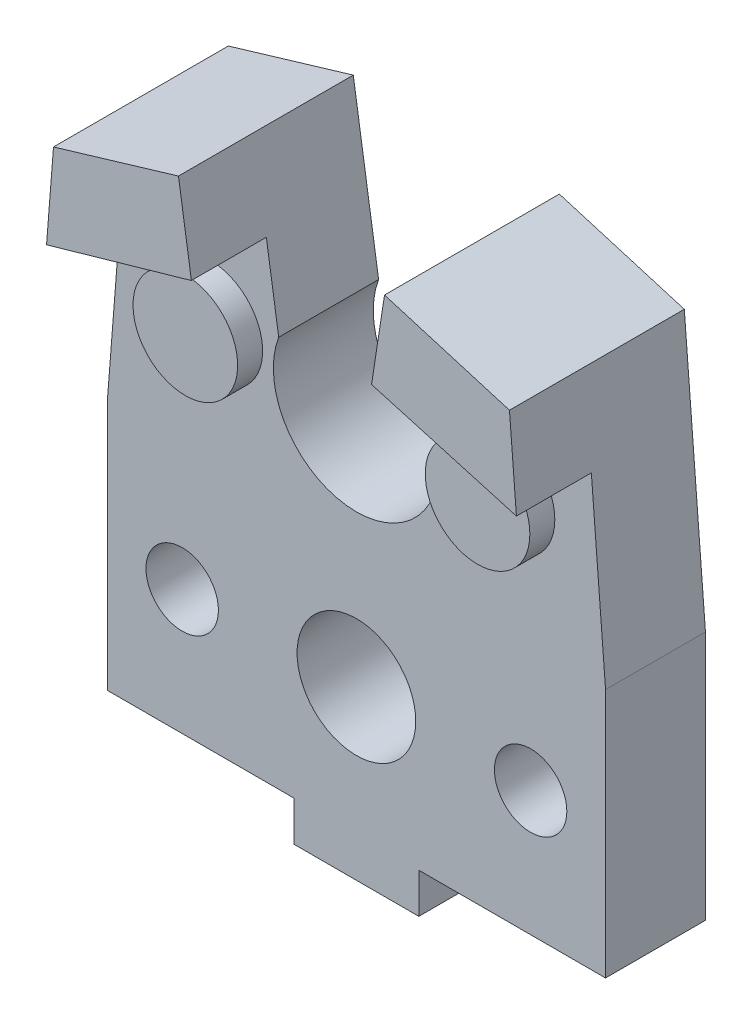
ISO-10303-21;
HEADER;
FILE_DESCRIPTION(('STEP AP214'),'2;1');
FILE_NAME('part.step','',(''),(''),'','','');
FILE_SCHEMA(('AUTOMOTIVE_DESIGN { 1 0 10303 214 1 1 1 1 }'));
ENDSEC;
DATA;
#1=APPLICATION_CONTEXT('core data for automotive mechanical design processes');
#2=APPLICATION_PROTOCOL_DEFINITION('international standard','automotive_design',2000,#1);
#3=PRODUCT_CONTEXT('',#1,'mechanical');
#4=PRODUCT('Part','Part','',(#3));
#5=PRODUCT_RELATED_PRODUCT_CATEGORY('part','',(#4));
#6=PRODUCT_DEFINITION_FORMATION('','',#4);
#7=PRODUCT_DEFINITION_CONTEXT('part definition',#1,'design');
#8=PRODUCT_DEFINITION('design','',#6,#7);
#9=PRODUCT_DEFINITION_SHAPE('','',#8);
#10=(LENGTH_UNIT() NAMED_UNIT(*) SI_UNIT(.MILLI.,.METRE.));
#11=(NAMED_UNIT(*) PLANE_ANGLE_UNIT() SI_UNIT($,.RADIAN.));
#12=(NAMED_UNIT(*) SI_UNIT($,.STERADIAN.) SOLID_ANGLE_UNIT());
#13=UNCERTAINTY_MEASURE_WITH_UNIT(LENGTH_MEASURE(1.E-05),#10,'distance_accuracy_value','');
#14=(GEOMETRIC_REPRESENTATION_CONTEXT(3) GLOBAL_UNCERTAINTY_ASSIGNED_CONTEXT((#13)) GLOBAL_UNIT_ASSIGNED_CONTEXT((#10,
#11,#12)) REPRESENTATION_CONTEXT('',''));
#15=CARTESIAN_POINT('',(0.,0.,0.));
#16=DIRECTION('',(0.,0.,1.));
#17=DIRECTION('',(1.,0.,0.));
#18=AXIS2_PLACEMENT_3D('',#15,#16,#17);
#19=CARTESIAN_POINT('',(0.,14.5,4.));
#20=DIRECTION('',(0.,0.,1.));
#21=DIRECTION('',(1.,0.,0.));
#22=AXIS2_PLACEMENT_3D('',#19,#20,#21);
#23=PLANE('',#22);
#24=CARTESIAN_POINT('',(5.84963031329266,14.8759344215206,4.));
#25=DIRECTION('',(0.,0.,1.));
#26=DIRECTION('',(1.,0.,0.));
#27=AXIS2_PLACEMENT_3D('',#24,#25,#26);
#28=CIRCLE('',#27,2.09451761320757);
#29=CARTESIAN_POINT('',(7.94414792650023,14.8759344215206,4.));
#30=VERTEX_POINT('',#29);
#31=EDGE_CURVE('E245',#30,#30,#28,.T.);
#32=ORIENTED_EDGE('',*,*,#31,.F.);
#33=EDGE_LOOP('',(#32));
#34=FACE_BOUND('',#33,.T.);
#35=CARTESIAN_POINT('',(0.,5.1,4.));
#36=DIRECTION('',(0.,0.,1.));
#37=DIRECTION('',(1.,0.,0.));
#38=AXIS2_PLACEMENT_3D('',#35,#36,#37);
#39=CIRCLE('',#38,2.375);
#40=CARTESIAN_POINT('',(2.375,5.1,4.));
#41=VERTEX_POINT('',#40);
#42=EDGE_CURVE('E253',#41,#41,#39,.T.);
#43=ORIENTED_EDGE('',*,*,#42,.F.);
#44=EDGE_LOOP('',(#43));
#45=FACE_BOUND('',#44,.T.);
#46=CARTESIAN_POINT('',(6.975,5.,4.));
#47=DIRECTION('',(0.,0.,1.));
#48=DIRECTION('',(1.,0.,0.));
#49=AXIS2_PLACEMENT_3D('',#46,#47,#48);
#50=CIRCLE('',#49,1.45);
#51=CARTESIAN_POINT('',(8.425,5.,4.));
#52=VERTEX_POINT('',#51);
#53=EDGE_CURVE('E263',#52,#52,#50,.T.);
#54=ORIENTED_EDGE('',*,*,#53,.F.);
#55=EDGE_LOOP('',(#54));
#56=FACE_BOUND('',#55,.T.);
#57=CARTESIAN_POINT('',(-6.975,5.,4.));
#58=DIRECTION('',(0.,0.,-1.));
#59=DIRECTION('',(-1.,0.,0.));
#60=AXIS2_PLACEMENT_3D('',#57,#58,#59);
#61=CIRCLE('',#60,1.45);
#62=CARTESIAN_POINT('',(-8.425,5.,4.));
#63=VERTEX_POINT('',#62);
#64=EDGE_CURVE('E259',#63,#63,#61,.T.);
#65=ORIENTED_EDGE('',*,*,#64,.T.);
#66=EDGE_LOOP('',(#65));
#67=FACE_BOUND('',#66,.T.);
#68=CARTESIAN_POINT('',(-5.84963031329266,14.8759344215206,4.));
#69=DIRECTION('',(0.,0.,1.));
#70=DIRECTION('',(-1.,0.,0.));
#71=AXIS2_PLACEMENT_3D('',#68,#69,#70);
#72=CIRCLE('',#71,2.09451761320757);
#73=CARTESIAN_POINT('',(-7.94414792650023,14.8759344215206,4.));
#74=VERTEX_POINT('',#73);
#75=EDGE_CURVE('E240',#74,#74,#72,.T.);
#76=ORIENTED_EDGE('',*,*,#75,.F.);
#77=EDGE_LOOP('',(#76));
#78=FACE_BOUND('',#77,.T.);
#79=DIRECTION('',(0.152370189997375,-0.988323492182678,0.));
#80=VECTOR('',#79,1.);
#81=CARTESIAN_POINT('',(-4.12514475526542,22.2565409840726,4.));
#82=LINE('',#81,#80);
#83=CARTESIAN_POINT('',(-3.60665876155312,18.8934691918646,4.));
#84=VERTEX_POINT('',#83);
#85=CARTESIAN_POINT('',(-3.11046620299916,15.675,4.));
#86=VERTEX_POINT('',#85);
#87=EDGE_CURVE('E444',#84,#86,#82,.T.);
#88=ORIENTED_EDGE('',*,*,#87,.F.);
#89=DIRECTION('',(0.961295074943608,0.275520922779311,0.));
#90=VECTOR('',#89,1.);
#91=CARTESIAN_POINT('',(-3.60665876155312,18.8934691918646,4.));
#92=LINE('',#91,#90);
#93=CARTESIAN_POINT('',(-9.40604841307085,17.2312811395262,4.));
#94=VERTEX_POINT('',#93);
#95=EDGE_CURVE('E203',#94,#84,#92,.T.);
#96=ORIENTED_EDGE('',*,*,#95,.F.);
#97=DIRECTION('',(0.0784368198986132,0.996919086628495,0.));
#98=VECTOR('',#97,1.);
#99=CARTESIAN_POINT('',(-9.975,10.,4.));
#100=LINE('',#99,#98);
#101=CARTESIAN_POINT('',(-9.975,10.,4.));
#102=VERTEX_POINT('',#101);
#103=EDGE_CURVE('E209',#102,#94,#100,.T.);
#104=ORIENTED_EDGE('',*,*,#103,.F.);
#105=DIRECTION('',(0.,1.,0.));
#106=VECTOR('',#105,1.);
#107=CARTESIAN_POINT('',(-9.975,0.,4.));
#108=LINE('',#107,#106);
#109=CARTESIAN_POINT('',(-9.975,0.,4.));
#110=VERTEX_POINT('',#109);
#111=EDGE_CURVE('E416',#110,#102,#108,.T.);
#112=ORIENTED_EDGE('',*,*,#111,.F.);
#113=DIRECTION('',(1.,0.,0.));
#114=VECTOR('',#113,1.);
#115=CARTESIAN_POINT('',(-9.975,0.,4.));
#116=LINE('',#115,#114);
#117=CARTESIAN_POINT('',(-2.5,0.,4.));
#118=VERTEX_POINT('',#117);
#119=EDGE_CURVE('E459',#110,#118,#116,.T.);
#120=ORIENTED_EDGE('',*,*,#119,.T.);
#121=DIRECTION('',(0.,1.,0.));
#122=VECTOR('',#121,1.);
#123=CARTESIAN_POINT('',(-2.5,0.,4.));
#124=LINE('',#123,#122);
#125=CARTESIAN_POINT('',(-2.5,-1.6,4.));
#126=VERTEX_POINT('',#125);
#127=EDGE_CURVE('E270',#126,#118,#124,.T.);
#128=ORIENTED_EDGE('',*,*,#127,.F.);
#129=DIRECTION('',(-1.,0.,0.));
#130=VECTOR('',#129,1.);
#131=CARTESIAN_POINT('',(2.5,-1.6,4.));
#132=LINE('',#131,#130);
#133=CARTESIAN_POINT('',(2.5,-1.6,4.));
#134=VERTEX_POINT('',#133);
#135=EDGE_CURVE('E267',#134,#126,#132,.T.);
#136=ORIENTED_EDGE('',*,*,#135,.F.);
#137=DIRECTION('',(0.,-1.,0.));
#138=VECTOR('',#137,1.);
#139=CARTESIAN_POINT('',(2.5,0.,4.));
#140=LINE('',#139,#138);
#141=CARTESIAN_POINT('',(2.5,0.,4.));
#142=VERTEX_POINT('',#141);
#143=EDGE_CURVE('E271',#142,#134,#140,.T.);
#144=ORIENTED_EDGE('',*,*,#143,.F.);
#145=CARTESIAN_POINT('',(9.975,0.,4.));
#146=VERTEX_POINT('',#145);
#147=EDGE_CURVE('E412',#142,#146,#116,.T.);
#148=ORIENTED_EDGE('',*,*,#147,.T.);
#149=DIRECTION('',(0.,1.,0.));
#150=VECTOR('',#149,1.);
#151=CARTESIAN_POINT('',(9.975,0.,4.));
#152=LINE('',#151,#150);
#153=CARTESIAN_POINT('',(9.975,10.,4.));
#154=VERTEX_POINT('',#153);
#155=EDGE_CURVE('E456',#146,#154,#152,.T.);
#156=ORIENTED_EDGE('',*,*,#155,.T.);
#157=DIRECTION('',(-0.0784368198986132,0.996919086628495,0.));
#158=VECTOR('',#157,1.);
#159=CARTESIAN_POINT('',(9.975,10.,4.));
#160=LINE('',#159,#158);
#161=CARTESIAN_POINT('',(9.40604841307084,17.2312811395262,4.));
#162=VERTEX_POINT('',#161);
#163=EDGE_CURVE('E59',#154,#162,#160,.T.);
#164=ORIENTED_EDGE('',*,*,#163,.T.);
#165=DIRECTION('',(0.961295074943608,-0.275520922779311,0.));
#166=VECTOR('',#165,1.);
#167=CARTESIAN_POINT('',(3.60665876155311,18.8934691918646,4.));
#168=LINE('',#167,#166);
#169=CARTESIAN_POINT('',(3.60665876155311,18.8934691918646,4.));
#170=VERTEX_POINT('',#169);
#171=EDGE_CURVE('E210',#170,#162,#168,.T.);
#172=ORIENTED_EDGE('',*,*,#171,.F.);
#173=DIRECTION('',(-0.152370189997375,-0.988323492182678,0.));
#174=VECTOR('',#173,1.);
#175=CARTESIAN_POINT('',(4.12514475526542,22.2565409840726,4.));
#176=LINE('',#175,#174);
#177=CARTESIAN_POINT('',(3.11046620299916,15.675,4.));
#178=VERTEX_POINT('',#177);
#179=EDGE_CURVE('E451',#170,#178,#176,.T.);
#180=ORIENTED_EDGE('',*,*,#179,.T.);
#181=CARTESIAN_POINT('',(0.,14.5,4.));
#182=DIRECTION('',(0.,0.,1.));
#183=DIRECTION('',(1.,0.,0.));
#184=AXIS2_PLACEMENT_3D('',#181,#182,#183);
#185=CIRCLE('',#184,3.325);
#186=EDGE_CURVE('E447',#86,#178,#185,.T.);
#187=ORIENTED_EDGE('',*,*,#186,.F.);
#188=EDGE_LOOP('',(#88,#96,#104,#112,#120,#128,#136,#144,#148,#156,#164,#172,#180,#187));
#189=FACE_BOUND('',#188,.T.);
#190=ADVANCED_FACE('F39',(#34,#45,#56,#67,#78,#189),#23,.T.);
#191=CARTESIAN_POINT('',(0.,14.5,0.));
#192=DIRECTION('',(0.,0.,1.));
#193=DIRECTION('',(1.,0.,0.));
#194=AXIS2_PLACEMENT_3D('',#191,#192,#193);
#195=PLANE('',#194);
#196=CARTESIAN_POINT('',(0.,5.1,0.));
#197=DIRECTION('',(0.,0.,1.));
#198=DIRECTION('',(1.,0.,0.));
#199=AXIS2_PLACEMENT_3D('',#196,#197,#198);
#200=CIRCLE('',#199,2.375);
#201=CARTESIAN_POINT('',(2.375,5.1,0.));
#202=VERTEX_POINT('',#201);
#203=EDGE_CURVE('E43',#202,#202,#200,.T.);
#204=ORIENTED_EDGE('',*,*,#203,.T.);
#205=EDGE_LOOP('',(#204));
#206=FACE_BOUND('',#205,.T.);
#207=DIRECTION('',(1.,0.,0.));
#208=VECTOR('',#207,1.);
#209=CARTESIAN_POINT('',(-9.975,0.,0.));
#210=LINE('',#209,#208);
#211=CARTESIAN_POINT('',(-9.975,0.,0.));
#212=VERTEX_POINT('',#211);
#213=CARTESIAN_POINT('',(-2.5,0.,0.));
#214=VERTEX_POINT('',#213);
#215=EDGE_CURVE('E371',#212,#214,#210,.T.);
#216=ORIENTED_EDGE('',*,*,#215,.F.);
#217=DIRECTION('',(0.,1.,0.));
#218=VECTOR('',#217,1.);
#219=CARTESIAN_POINT('',(-9.975,0.,0.));
#220=LINE('',#219,#218);
#221=CARTESIAN_POINT('',(-9.975,10.,0.));
#222=VERTEX_POINT('',#221);
#223=EDGE_CURVE('E409',#212,#222,#220,.T.);
#224=ORIENTED_EDGE('',*,*,#223,.T.);
#225=DIRECTION('',(0.0784368198986132,0.996919086628495,0.));
#226=VECTOR('',#225,1.);
#227=CARTESIAN_POINT('',(-9.975,10.,0.));
#228=LINE('',#227,#226);
#229=CARTESIAN_POINT('',(-9.12809574650757,20.764013838715,0.));
#230=VERTEX_POINT('',#229);
#231=EDGE_CURVE('E405',#222,#230,#228,.T.);
#232=ORIENTED_EDGE('',*,*,#231,.T.);
#233=DIRECTION('',(0.958265779693073,0.285878812557396,0.));
#234=VECTOR('',#233,1.);
#235=CARTESIAN_POINT('',(-9.12809574650757,20.764013838715,0.));
#236=LINE('',#235,#234);
#237=CARTESIAN_POINT('',(-4.12514475526542,22.2565409840726,0.));
#238=VERTEX_POINT('',#237);
#239=EDGE_CURVE('E401',#230,#238,#236,.T.);
#240=ORIENTED_EDGE('',*,*,#239,.T.);
#241=DIRECTION('',(0.152370189997375,-0.988323492182678,0.));
#242=VECTOR('',#241,1.);
#243=CARTESIAN_POINT('',(-4.12514475526542,22.2565409840726,0.));
#244=LINE('',#243,#242);
#245=CARTESIAN_POINT('',(-3.11046620299916,15.675,0.));
#246=VERTEX_POINT('',#245);
#247=EDGE_CURVE('E397',#238,#246,#244,.T.);
#248=ORIENTED_EDGE('',*,*,#247,.T.);
#249=CARTESIAN_POINT('',(0.,14.5,0.));
#250=DIRECTION('',(0.,0.,1.));
#251=DIRECTION('',(1.,0.,0.));
#252=AXIS2_PLACEMENT_3D('',#249,#250,#251);
#253=CIRCLE('',#252,3.325);
#254=CARTESIAN_POINT('',(3.11046620299916,15.675,0.));
#255=VERTEX_POINT('',#254);
#256=EDGE_CURVE('E393',#246,#255,#253,.T.);
#257=ORIENTED_EDGE('',*,*,#256,.T.);
#258=DIRECTION('',(-0.152370189997375,-0.988323492182678,0.));
#259=VECTOR('',#258,1.);
#260=CARTESIAN_POINT('',(4.12514475526542,22.2565409840726,0.));
#261=LINE('',#260,#259);
#262=CARTESIAN_POINT('',(4.12514475526542,22.2565409840726,0.));
#263=VERTEX_POINT('',#262);
#264=EDGE_CURVE('E386',#263,#255,#261,.T.);
#265=ORIENTED_EDGE('',*,*,#264,.F.);
#266=DIRECTION('',(-0.958265779693073,0.285878812557396,0.));
#267=VECTOR('',#266,1.);
#268=CARTESIAN_POINT('',(9.12809574650757,20.764013838715,0.));
#269=LINE('',#268,#267);
#270=CARTESIAN_POINT('',(9.12809574650757,20.764013838715,0.));
#271=VERTEX_POINT('',#270);
#272=EDGE_CURVE('E381',#271,#263,#269,.T.);
#273=ORIENTED_EDGE('',*,*,#272,.F.);
#274=DIRECTION('',(-0.0784368198986132,0.996919086628495,0.));
#275=VECTOR('',#274,1.);
#276=CARTESIAN_POINT('',(9.975,10.,0.));
#277=LINE('',#276,#275);
#278=CARTESIAN_POINT('',(9.975,10.,0.));
#279=VERTEX_POINT('',#278);
#280=EDGE_CURVE('E370',#279,#271,#277,.T.);
#281=ORIENTED_EDGE('',*,*,#280,.F.);
#282=DIRECTION('',(0.,1.,0.));
#283=VECTOR('',#282,1.);
#284=CARTESIAN_POINT('',(9.975,0.,0.));
#285=LINE('',#284,#283);
#286=CARTESIAN_POINT('',(9.975,0.,0.));
#287=VERTEX_POINT('',#286);
#288=EDGE_CURVE('E363',#287,#279,#285,.T.);
#289=ORIENTED_EDGE('',*,*,#288,.F.);
#290=CARTESIAN_POINT('',(2.5,0.,0.));
#291=VERTEX_POINT('',#290);
#292=EDGE_CURVE('E284',#291,#287,#210,.T.);
#293=ORIENTED_EDGE('',*,*,#292,.F.);
#294=DIRECTION('',(0.,-1.,0.));
#295=VECTOR('',#294,1.);
#296=CARTESIAN_POINT('',(2.5,0.,0.));
#297=LINE('',#296,#295);
#298=CARTESIAN_POINT('',(2.5,-1.6,0.));
#299=VERTEX_POINT('',#298);
#300=EDGE_CURVE('E67',#291,#299,#297,.T.);
#301=ORIENTED_EDGE('',*,*,#300,.T.);
#302=DIRECTION('',(-1.,0.,0.));
#303=VECTOR('',#302,1.);
#304=CARTESIAN_POINT('',(2.5,-1.6,0.));
#305=LINE('',#304,#303);
#306=CARTESIAN_POINT('',(-2.5,-1.6,0.));
#307=VERTEX_POINT('',#306);
#308=EDGE_CURVE('E272',#299,#307,#305,.T.);
#309=ORIENTED_EDGE('',*,*,#308,.T.);
#310=DIRECTION('',(0.,1.,0.));
#311=VECTOR('',#310,1.);
#312=CARTESIAN_POINT('',(-2.5,0.,0.));
#313=LINE('',#312,#311);
#314=EDGE_CURVE('E275',#307,#214,#313,.T.);
#315=ORIENTED_EDGE('',*,*,#314,.T.);
#316=EDGE_LOOP('',(#216,#224,#232,#240,#248,#257,#265,#273,#281,#289,#293,#301,#309,#315));
#317=FACE_BOUND('',#316,.T.);
#318=CARTESIAN_POINT('',(6.975,5.,0.));
#319=DIRECTION('',(0.,0.,1.));
#320=DIRECTION('',(1.,0.,0.));
#321=AXIS2_PLACEMENT_3D('',#318,#319,#320);
#322=CIRCLE('',#321,1.45);
#323=CARTESIAN_POINT('',(8.425,5.,0.));
#324=VERTEX_POINT('',#323);
#325=EDGE_CURVE('E266',#324,#324,#322,.T.);
#326=ORIENTED_EDGE('',*,*,#325,.T.);
#327=EDGE_LOOP('',(#326));
#328=FACE_BOUND('',#327,.T.);
#329=CARTESIAN_POINT('',(-6.975,5.,0.));
#330=DIRECTION('',(0.,0.,1.));
#331=DIRECTION('',(1.,0.,0.));
#332=AXIS2_PLACEMENT_3D('',#329,#330,#331);
#333=CIRCLE('',#332,1.45);
#334=CARTESIAN_POINT('',(-5.525,5.,0.));
#335=VERTEX_POINT('',#334);
#336=EDGE_CURVE('E262',#335,#335,#333,.F.);
#337=ORIENTED_EDGE('',*,*,#336,.F.);
#338=EDGE_LOOP('',(#337));
#339=FACE_BOUND('',#338,.T.);
#340=ADVANCED_FACE('F308',(#206,#317,#328,#339),#195,.F.);
#341=CARTESIAN_POINT('',(-9.975,0.,4.));
#342=DIRECTION('',(0.,1.,0.));
#343=DIRECTION('',(0.,0.,1.));
#344=AXIS2_PLACEMENT_3D('',#341,#342,#343);
#345=PLANE('',#344);
#346=DIRECTION('',(0.,0.,-1.));
#347=VECTOR('',#346,1.);
#348=CARTESIAN_POINT('',(-2.5,0.,4.));
#349=LINE('',#348,#347);
#350=EDGE_CURVE('E285',#118,#214,#349,.T.);
#351=ORIENTED_EDGE('',*,*,#350,.F.);
#352=ORIENTED_EDGE('',*,*,#119,.F.);
#353=DIRECTION('',(0.,0.,-1.));
#354=VECTOR('',#353,1.);
#355=CARTESIAN_POINT('',(-9.975,0.,4.));
#356=LINE('',#355,#354);
#357=EDGE_CURVE('E413',#110,#212,#356,.T.);
#358=ORIENTED_EDGE('',*,*,#357,.T.);
#359=ORIENTED_EDGE('',*,*,#215,.T.);
#360=EDGE_LOOP('',(#351,#352,#358,#359));
#361=FACE_BOUND('',#360,.T.);
#362=ADVANCED_FACE('F310',(#361),#345,.F.);
#363=ORIENTED_EDGE('',*,*,#147,.F.);
#364=DIRECTION('',(0.,0.,-1.));
#365=VECTOR('',#364,1.);
#366=CARTESIAN_POINT('',(2.5,0.,4.));
#367=LINE('',#366,#365);
#368=EDGE_CURVE('E281',#142,#291,#367,.T.);
#369=ORIENTED_EDGE('',*,*,#368,.T.);
#370=ORIENTED_EDGE('',*,*,#292,.T.);
#371=DIRECTION('',(0.,0.,-1.));
#372=VECTOR('',#371,1.);
#373=CARTESIAN_POINT('',(9.975,0.,4.));
#374=LINE('',#373,#372);
#375=EDGE_CURVE('E11',#146,#287,#374,.T.);
#376=ORIENTED_EDGE('',*,*,#375,.F.);
#377=EDGE_LOOP('',(#363,#369,#370,#376));
#378=FACE_BOUND('',#377,.T.);
#379=ADVANCED_FACE('F41',(#378),#345,.F.);
#380=CARTESIAN_POINT('',(9.975,0.,4.));
#381=DIRECTION('',(-1.,0.,0.));
#382=DIRECTION('',(0.,-1.,0.));
#383=AXIS2_PLACEMENT_3D('',#380,#381,#382);
#384=PLANE('',#383);
#385=ORIENTED_EDGE('',*,*,#288,.T.);
#386=DIRECTION('',(0.,0.,-1.));
#387=VECTOR('',#386,1.);
#388=CARTESIAN_POINT('',(9.975,10.,4.));
#389=LINE('',#388,#387);
#390=EDGE_CURVE('E48',#154,#279,#389,.T.);
#391=ORIENTED_EDGE('',*,*,#390,.F.);
#392=ORIENTED_EDGE('',*,*,#155,.F.);
#393=ORIENTED_EDGE('',*,*,#375,.T.);
#394=EDGE_LOOP('',(#385,#391,#392,#393));
#395=FACE_BOUND('',#394,.T.);
#396=ADVANCED_FACE('F353',(#395),#384,.F.);
#397=CARTESIAN_POINT('',(9.975,10.,4.));
#398=DIRECTION('',(-0.996919086628495,-0.0784368198986132,0.));
#399=DIRECTION('',(0.0784368198986132,-0.996919086628495,0.));
#400=AXIS2_PLACEMENT_3D('',#397,#398,#399);
#401=PLANE('',#400);
#402=ORIENTED_EDGE('',*,*,#280,.T.);
#403=DIRECTION('',(0.,0.,-1.));
#404=VECTOR('',#403,1.);
#405=CARTESIAN_POINT('',(9.12809574650757,20.764013838715,4.));
#406=LINE('',#405,#404);
#407=CARTESIAN_POINT('',(9.12809574650757,20.764013838715,7.));
#408=VERTEX_POINT('',#407);
#409=EDGE_CURVE('E375',#408,#271,#406,.T.);
#410=ORIENTED_EDGE('',*,*,#409,.F.);
#411=DIRECTION('',(-0.0784368198986135,0.996919086628495,0.));
#412=VECTOR('',#411,1.);
#413=CARTESIAN_POINT('',(9.40604841307084,17.2312811395262,7.));
#414=LINE('',#413,#412);
#415=CARTESIAN_POINT('',(9.40604841307084,17.2312811395262,7.));
#416=VERTEX_POINT('',#415);
#417=EDGE_CURVE('E228',#416,#408,#414,.T.);
#418=ORIENTED_EDGE('',*,*,#417,.F.);
#419=DIRECTION('',(0.,0.,-1.));
#420=VECTOR('',#419,1.);
#421=CARTESIAN_POINT('',(9.40604841307084,17.2312811395262,7.));
#422=LINE('',#421,#420);
#423=EDGE_CURVE('E231',#416,#162,#422,.T.);
#424=ORIENTED_EDGE('',*,*,#423,.T.);
#425=ORIENTED_EDGE('',*,*,#163,.F.);
#426=ORIENTED_EDGE('',*,*,#390,.T.);
#427=EDGE_LOOP('',(#402,#410,#418,#424,#425,#426));
#428=FACE_BOUND('',#427,.T.);
#429=ADVANCED_FACE('F350',(#428),#401,.F.);
#430=CARTESIAN_POINT('',(9.12809574650757,20.764013838715,4.));
#431=DIRECTION('',(-0.285878812557396,-0.958265779693073,0.));
#432=DIRECTION('',(0.958265779693073,-0.285878812557396,0.));
#433=AXIS2_PLACEMENT_3D('',#430,#431,#432);
#434=PLANE('',#433);
#435=ORIENTED_EDGE('',*,*,#272,.T.);
#436=DIRECTION('',(0.,0.,-1.));
#437=VECTOR('',#436,1.);
#438=CARTESIAN_POINT('',(4.12514475526542,22.2565409840726,4.));
#439=LINE('',#438,#437);
#440=CARTESIAN_POINT('',(4.12514475526542,22.2565409840726,7.));
#441=VERTEX_POINT('',#440);
#442=EDGE_CURVE('E430',#441,#263,#439,.T.);
#443=ORIENTED_EDGE('',*,*,#442,.F.);
#444=DIRECTION('',(-0.958265779693073,0.285878812557396,0.));
#445=VECTOR('',#444,1.);
#446=CARTESIAN_POINT('',(9.12809574650757,20.764013838715,7.));
#447=LINE('',#446,#445);
#448=EDGE_CURVE('E213',#408,#441,#447,.T.);
#449=ORIENTED_EDGE('',*,*,#448,.F.);
#450=ORIENTED_EDGE('',*,*,#409,.T.);
#451=EDGE_LOOP('',(#435,#443,#449,#450));
#452=FACE_BOUND('',#451,.T.);
#453=ADVANCED_FACE('F346',(#452),#434,.F.);
#454=CARTESIAN_POINT('',(4.12514475526542,22.2565409840726,4.));
#455=DIRECTION('',(0.988323492182678,-0.152370189997375,0.));
#456=DIRECTION('',(0.152370189997375,0.988323492182678,0.));
#457=AXIS2_PLACEMENT_3D('',#454,#455,#456);
#458=PLANE('',#457);
#459=ORIENTED_EDGE('',*,*,#264,.T.);
#460=DIRECTION('',(0.,0.,-1.));
#461=VECTOR('',#460,1.);
#462=CARTESIAN_POINT('',(3.11046620299916,15.675,4.));
#463=LINE('',#462,#461);
#464=EDGE_CURVE('E427',#178,#255,#463,.T.);
#465=ORIENTED_EDGE('',*,*,#464,.F.);
#466=ORIENTED_EDGE('',*,*,#179,.F.);
#467=DIRECTION('',(0.,0.,-1.));
#468=VECTOR('',#467,1.);
#469=CARTESIAN_POINT('',(3.60665876155311,18.8934691918646,7.));
#470=LINE('',#469,#468);
#471=CARTESIAN_POINT('',(3.60665876155311,18.8934691918646,7.));
#472=VERTEX_POINT('',#471);
#473=EDGE_CURVE('E236',#472,#170,#470,.T.);
#474=ORIENTED_EDGE('',*,*,#473,.F.);
#475=DIRECTION('',(-0.152370189997376,-0.988323492182678,0.));
#476=VECTOR('',#475,1.);
#477=CARTESIAN_POINT('',(4.12514475526542,22.2565409840726,7.));
#478=LINE('',#477,#476);
#479=EDGE_CURVE('E222',#441,#472,#478,.T.);
#480=ORIENTED_EDGE('',*,*,#479,.F.);
#481=ORIENTED_EDGE('',*,*,#442,.T.);
#482=EDGE_LOOP('',(#459,#465,#466,#474,#480,#481));
#483=FACE_BOUND('',#482,.T.);
#484=ADVANCED_FACE('F342',(#483),#458,.F.);
#485=CARTESIAN_POINT('',(0.,14.5,4.));
#486=DIRECTION('',(0.,0.,-1.));
#487=DIRECTION('',(-1.,0.,0.));
#488=AXIS2_PLACEMENT_3D('',#485,#486,#487);
#489=CYLINDRICAL_SURFACE('',#488,3.325);
#490=ORIENTED_EDGE('',*,*,#256,.F.);
#491=DIRECTION('',(0.,0.,-1.));
#492=VECTOR('',#491,1.);
#493=CARTESIAN_POINT('',(-3.11046620299916,15.675,4.));
#494=LINE('',#493,#492);
#495=EDGE_CURVE('E424',#86,#246,#494,.T.);
#496=ORIENTED_EDGE('',*,*,#495,.F.);
#497=ORIENTED_EDGE('',*,*,#186,.T.);
#498=ORIENTED_EDGE('',*,*,#464,.T.);
#499=EDGE_LOOP('',(#490,#496,#497,#498));
#500=FACE_BOUND('',#499,.T.);
#501=ADVANCED_FACE('F338',(#500),#489,.F.);
#502=CARTESIAN_POINT('',(-4.12514475526542,22.2565409840726,4.));
#503=DIRECTION('',(0.988323492182678,0.152370189997375,0.));
#504=DIRECTION('',(-0.152370189997375,0.988323492182678,0.));
#505=AXIS2_PLACEMENT_3D('',#502,#503,#504);
#506=PLANE('',#505);
#507=ORIENTED_EDGE('',*,*,#247,.F.);
#508=DIRECTION('',(0.,0.,-1.));
#509=VECTOR('',#508,1.);
#510=CARTESIAN_POINT('',(-4.12514475526542,22.2565409840726,4.));
#511=LINE('',#510,#509);
#512=CARTESIAN_POINT('',(-4.12514475526542,22.2565409840726,7.));
#513=VERTEX_POINT('',#512);
#514=EDGE_CURVE('E421',#513,#238,#511,.T.);
#515=ORIENTED_EDGE('',*,*,#514,.F.);
#516=DIRECTION('',(-0.152370189997374,0.988323492182678,0.));
#517=VECTOR('',#516,1.);
#518=CARTESIAN_POINT('',(-4.12514475526542,22.2565409840726,7.));
#519=LINE('',#518,#517);
#520=CARTESIAN_POINT('',(-3.60665876155312,18.8934691918646,7.));
#521=VERTEX_POINT('',#520);
#522=EDGE_CURVE('E194',#521,#513,#519,.T.);
#523=ORIENTED_EDGE('',*,*,#522,.F.);
#524=DIRECTION('',(0.,0.,-1.));
#525=VECTOR('',#524,1.);
#526=CARTESIAN_POINT('',(-3.60665876155312,18.8934691918646,7.));
#527=LINE('',#526,#525);
#528=EDGE_CURVE('E190',#521,#84,#527,.T.);
#529=ORIENTED_EDGE('',*,*,#528,.T.);
#530=ORIENTED_EDGE('',*,*,#87,.T.);
#531=ORIENTED_EDGE('',*,*,#495,.T.);
#532=EDGE_LOOP('',(#507,#515,#523,#529,#530,#531));
#533=FACE_BOUND('',#532,.T.);
#534=ADVANCED_FACE('F334',(#533),#506,.T.);
#535=CARTESIAN_POINT('',(-9.12809574650757,20.764013838715,4.));
#536=DIRECTION('',(-0.285878812557396,0.958265779693073,0.));
#537=DIRECTION('',(-0.958265779693073,-0.285878812557396,0.));
#538=AXIS2_PLACEMENT_3D('',#535,#536,#537);
#539=PLANE('',#538);
#540=ORIENTED_EDGE('',*,*,#239,.F.);
#541=DIRECTION('',(0.,0.,-1.));
#542=VECTOR('',#541,1.);
#543=CARTESIAN_POINT('',(-9.12809574650757,20.764013838715,4.));
#544=LINE('',#543,#542);
#545=CARTESIAN_POINT('',(-9.12809574650757,20.764013838715,7.));
#546=VERTEX_POINT('',#545);
#547=EDGE_CURVE('E418',#546,#230,#544,.T.);
#548=ORIENTED_EDGE('',*,*,#547,.F.);
#549=DIRECTION('',(-0.958265779693073,-0.285878812557396,0.));
#550=VECTOR('',#549,1.);
#551=CARTESIAN_POINT('',(-9.12809574650757,20.764013838715,7.));
#552=LINE('',#551,#550);
#553=EDGE_CURVE('E201',#513,#546,#552,.T.);
#554=ORIENTED_EDGE('',*,*,#553,.F.);
#555=ORIENTED_EDGE('',*,*,#514,.T.);
#556=EDGE_LOOP('',(#540,#548,#554,#555));
#557=FACE_BOUND('',#556,.T.);
#558=ADVANCED_FACE('F331',(#557),#539,.T.);
#559=CARTESIAN_POINT('',(-9.975,10.,4.));
#560=DIRECTION('',(-0.996919086628495,0.0784368198986132,0.));
#561=DIRECTION('',(-0.0784368198986132,-0.996919086628495,0.));
#562=AXIS2_PLACEMENT_3D('',#559,#560,#561);
#563=PLANE('',#562);
#564=ORIENTED_EDGE('',*,*,#231,.F.);
#565=DIRECTION('',(0.,0.,-1.));
#566=VECTOR('',#565,1.);
#567=CARTESIAN_POINT('',(-9.975,10.,4.));
#568=LINE('',#567,#566);
#569=EDGE_CURVE('E415',#102,#222,#568,.T.);
#570=ORIENTED_EDGE('',*,*,#569,.F.);
#571=ORIENTED_EDGE('',*,*,#103,.T.);
#572=DIRECTION('',(0.,0.,-1.));
#573=VECTOR('',#572,1.);
#574=CARTESIAN_POINT('',(-9.40604841307085,17.2312811395262,7.));
#575=LINE('',#574,#573);
#576=CARTESIAN_POINT('',(-9.40604841307085,17.2312811395262,7.));
#577=VERTEX_POINT('',#576);
#578=EDGE_CURVE('E187',#577,#94,#575,.T.);
#579=ORIENTED_EDGE('',*,*,#578,.F.);
#580=DIRECTION('',(-0.0784368198986154,-0.996919086628495,0.));
#581=VECTOR('',#580,1.);
#582=CARTESIAN_POINT('',(-9.40604841307085,17.2312811395262,7.));
#583=LINE('',#582,#581);
#584=EDGE_CURVE('E195',#546,#577,#583,.T.);
#585=ORIENTED_EDGE('',*,*,#584,.F.);
#586=ORIENTED_EDGE('',*,*,#547,.T.);
#587=EDGE_LOOP('',(#564,#570,#571,#579,#585,#586));
#588=FACE_BOUND('',#587,.T.);
#589=ADVANCED_FACE('F207',(#588),#563,.T.);
#590=CARTESIAN_POINT('',(-9.975,0.,4.));
#591=DIRECTION('',(-1.,0.,0.));
#592=DIRECTION('',(0.,-1.,0.));
#593=AXIS2_PLACEMENT_3D('',#590,#591,#592);
#594=PLANE('',#593);
#595=ORIENTED_EDGE('',*,*,#223,.F.);
#596=ORIENTED_EDGE('',*,*,#357,.F.);
#597=ORIENTED_EDGE('',*,*,#111,.T.);
#598=ORIENTED_EDGE('',*,*,#569,.T.);
#599=EDGE_LOOP('',(#595,#596,#597,#598));
#600=FACE_BOUND('',#599,.T.);
#601=ADVANCED_FACE('F324',(#600),#594,.T.);
#602=CARTESIAN_POINT('',(2.5,0.,4.));
#603=DIRECTION('',(1.,0.,0.));
#604=DIRECTION('',(0.,0.,-1.));
#605=AXIS2_PLACEMENT_3D('',#602,#603,#604);
#606=PLANE('',#605);
#607=ORIENTED_EDGE('',*,*,#300,.F.);
#608=ORIENTED_EDGE('',*,*,#368,.F.);
#609=ORIENTED_EDGE('',*,*,#143,.T.);
#610=DIRECTION('',(0.,0.,-1.));
#611=VECTOR('',#610,1.);
#612=CARTESIAN_POINT('',(2.5,-1.6,4.));
#613=LINE('',#612,#611);
#614=EDGE_CURVE('E295',#134,#299,#613,.T.);
#615=ORIENTED_EDGE('',*,*,#614,.T.);
#616=EDGE_LOOP('',(#607,#608,#609,#615));
#617=FACE_BOUND('',#616,.T.);
#618=ADVANCED_FACE('F327',(#617),#606,.T.);
#619=CARTESIAN_POINT('',(-2.5,0.,4.));
#620=DIRECTION('',(-1.,0.,0.));
#621=DIRECTION('',(0.,0.,1.));
#622=AXIS2_PLACEMENT_3D('',#619,#620,#621);
#623=PLANE('',#622);
#624=ORIENTED_EDGE('',*,*,#314,.F.);
#625=DIRECTION('',(0.,0.,-1.));
#626=VECTOR('',#625,1.);
#627=CARTESIAN_POINT('',(-2.5,-1.6,4.));
#628=LINE('',#627,#626);
#629=EDGE_CURVE('E293',#126,#307,#628,.T.);
#630=ORIENTED_EDGE('',*,*,#629,.F.);
#631=ORIENTED_EDGE('',*,*,#127,.T.);
#632=ORIENTED_EDGE('',*,*,#350,.T.);
#633=EDGE_LOOP('',(#624,#630,#631,#632));
#634=FACE_BOUND('',#633,.T.);
#635=ADVANCED_FACE('F477',(#634),#623,.T.);
#636=CARTESIAN_POINT('',(2.5,-1.6,4.));
#637=DIRECTION('',(0.,-1.,0.));
#638=DIRECTION('',(0.,0.,-1.));
#639=AXIS2_PLACEMENT_3D('',#636,#637,#638);
#640=PLANE('',#639);
#641=ORIENTED_EDGE('',*,*,#308,.F.);
#642=ORIENTED_EDGE('',*,*,#614,.F.);
#643=ORIENTED_EDGE('',*,*,#135,.T.);
#644=ORIENTED_EDGE('',*,*,#629,.T.);
#645=EDGE_LOOP('',(#641,#642,#643,#644));
#646=FACE_BOUND('',#645,.T.);
#647=ADVANCED_FACE('F475',(#646),#640,.T.);
#648=CARTESIAN_POINT('',(6.975,5.,-10.2));
#649=DIRECTION('',(0.,0.,1.));
#650=DIRECTION('',(1.,0.,0.));
#651=AXIS2_PLACEMENT_3D('',#648,#649,#650);
#652=CYLINDRICAL_SURFACE('',#651,1.45);
#653=ORIENTED_EDGE('',*,*,#53,.T.);
#654=EDGE_LOOP('',(#653));
#655=FACE_BOUND('',#654,.T.);
#656=ORIENTED_EDGE('',*,*,#325,.F.);
#657=EDGE_LOOP('',(#656));
#658=FACE_BOUND('',#657,.T.);
#659=ADVANCED_FACE('F529',(#655,#658),#652,.F.);
#660=CARTESIAN_POINT('',(-6.975,5.,-10.2));
#661=DIRECTION('',(0.,0.,1.));
#662=DIRECTION('',(1.,0.,0.));
#663=AXIS2_PLACEMENT_3D('',#660,#661,#662);
#664=CYLINDRICAL_SURFACE('',#663,1.45);
#665=ORIENTED_EDGE('',*,*,#64,.F.);
#666=EDGE_LOOP('',(#665));
#667=FACE_BOUND('',#666,.T.);
#668=ORIENTED_EDGE('',*,*,#336,.T.);
#669=EDGE_LOOP('',(#668));
#670=FACE_BOUND('',#669,.T.);
#671=ADVANCED_FACE('F306',(#667,#670),#664,.F.);
#672=CARTESIAN_POINT('',(0.,5.1,-11.));
#673=DIRECTION('',(0.,0.,1.));
#674=DIRECTION('',(1.,0.,0.));
#675=AXIS2_PLACEMENT_3D('',#672,#673,#674);
#676=CYLINDRICAL_SURFACE('',#675,2.375);
#677=CARTESIAN_POINT('',(2.375,5.1,4.));
#678=CARTESIAN_POINT('',(2.375,5.1,3.95833333333333));
#679=CARTESIAN_POINT('',(2.375,5.1,3.91666666666667));
#680=CARTESIAN_POINT('',(2.375,5.1,3.83333333333333));
#681=CARTESIAN_POINT('',(2.375,5.1,3.79166666666667));
#682=CARTESIAN_POINT('',(2.375,5.1,3.70833333333333));
#683=CARTESIAN_POINT('',(2.375,5.1,3.66666666666667));
#684=CARTESIAN_POINT('',(2.375,5.1,3.58333333333333));
#685=CARTESIAN_POINT('',(2.375,5.1,3.54166666666667));
#686=CARTESIAN_POINT('',(2.375,5.1,3.45833333333333));
#687=CARTESIAN_POINT('',(2.375,5.1,3.41666666666667));
#688=CARTESIAN_POINT('',(2.375,5.1,3.33333333333333));
#689=CARTESIAN_POINT('',(2.375,5.1,3.29166666666667));
#690=CARTESIAN_POINT('',(2.375,5.1,3.20833333333333));
#691=CARTESIAN_POINT('',(2.375,5.1,3.16666666666667));
#692=CARTESIAN_POINT('',(2.375,5.1,3.08333333333333));
#693=CARTESIAN_POINT('',(2.375,5.1,3.04166666666667));
#694=CARTESIAN_POINT('',(2.375,5.1,2.95833333333333));
#695=CARTESIAN_POINT('',(2.375,5.1,2.91666666666667));
#696=CARTESIAN_POINT('',(2.375,5.1,2.83333333333333));
#697=CARTESIAN_POINT('',(2.375,5.1,2.79166666666667));
#698=CARTESIAN_POINT('',(2.375,5.1,2.70833333333333));
#699=CARTESIAN_POINT('',(2.375,5.1,2.66666666666667));
#700=CARTESIAN_POINT('',(2.375,5.1,2.58333333333333));
#701=CARTESIAN_POINT('',(2.375,5.1,2.54166666666667));
#702=CARTESIAN_POINT('',(2.375,5.1,2.45833333333333));
#703=CARTESIAN_POINT('',(2.375,5.1,2.41666666666667));
#704=CARTESIAN_POINT('',(2.375,5.1,2.33333333333333));
#705=CARTESIAN_POINT('',(2.375,5.1,2.29166666666667));
#706=CARTESIAN_POINT('',(2.375,5.1,2.20833333333333));
#707=CARTESIAN_POINT('',(2.375,5.1,2.16666666666667));
#708=CARTESIAN_POINT('',(2.375,5.1,2.08333333333333));
#709=CARTESIAN_POINT('',(2.375,5.1,2.04166666666667));
#710=CARTESIAN_POINT('',(2.375,5.1,1.95833333333333));
#711=CARTESIAN_POINT('',(2.375,5.1,1.91666666666667));
#712=CARTESIAN_POINT('',(2.375,5.1,1.83333333333333));
#713=CARTESIAN_POINT('',(2.375,5.1,1.79166666666667));
#714=CARTESIAN_POINT('',(2.375,5.1,1.70833333333333));
#715=CARTESIAN_POINT('',(2.375,5.1,1.66666666666667));
#716=CARTESIAN_POINT('',(2.375,5.1,1.58333333333333));
#717=CARTESIAN_POINT('',(2.375,5.1,1.54166666666667));
#718=CARTESIAN_POINT('',(2.375,5.1,1.45833333333333));
#719=CARTESIAN_POINT('',(2.375,5.1,1.41666666666667));
#720=CARTESIAN_POINT('',(2.375,5.1,1.33333333333333));
#721=CARTESIAN_POINT('',(2.375,5.1,1.29166666666667));
#722=CARTESIAN_POINT('',(2.375,5.1,1.20833333333333));
#723=CARTESIAN_POINT('',(2.375,5.1,1.16666666666667));
#724=CARTESIAN_POINT('',(2.375,5.1,1.08333333333333));
#725=CARTESIAN_POINT('',(2.375,5.1,1.04166666666667));
#726=CARTESIAN_POINT('',(2.375,5.1,0.958333333333334));
#727=CARTESIAN_POINT('',(2.375,5.1,0.916666666666668));
#728=CARTESIAN_POINT('',(2.375,5.1,0.833333333333334));
#729=CARTESIAN_POINT('',(2.375,5.1,0.791666666666667));
#730=CARTESIAN_POINT('',(2.375,5.1,0.708333333333334));
#731=CARTESIAN_POINT('',(2.375,5.1,0.666666666666667));
#732=CARTESIAN_POINT('',(2.375,5.1,0.583333333333334));
#733=CARTESIAN_POINT('',(2.375,5.1,0.541666666666667));
#734=CARTESIAN_POINT('',(2.375,5.1,0.458333333333334));
#735=CARTESIAN_POINT('',(2.375,5.1,0.416666666666667));
#736=CARTESIAN_POINT('',(2.375,5.1,0.333333333333334));
#737=CARTESIAN_POINT('',(2.375,5.1,0.291666666666667));
#738=CARTESIAN_POINT('',(2.375,5.1,0.208333333333334));
#739=CARTESIAN_POINT('',(2.375,5.1,0.166666666666667));
#740=CARTESIAN_POINT('',(2.375,5.1,0.0833333333333334));
#741=CARTESIAN_POINT('',(2.375,5.1,0.0416666666666667));
#742=CARTESIAN_POINT('',(2.375,5.1,0.));
#743=B_SPLINE_CURVE_WITH_KNOTS('',3,(#677,#678,#679,#680,#681,#682,#683,#684,#685,#686,#687,
#688,#689,#690,#691,#692,#693,#694,#695,#696,#697,#698,#699,#700,#701,#702,#703,#704,#705,#706,
#707,#708,#709,#710,#711,#712,#713,#714,#715,#716,#717,#718,#719,#720,#721,#722,#723,#724,#725,
#726,#727,#728,#729,#730,#731,#732,#733,#734,#735,#736,#737,#738,#739,#740,#741,#742),
.UNSPECIFIED.,.F.,.F.,(4,2,2,2,2,2,2,2,2,2,2,2,2,2,2,2,2,2,2,2,2,2,2,2,2,2,2,2,2,2,2,2,4),(0.,
0.125,0.25,0.375,0.5,0.625000000000001,0.750000000000001,0.875000000000001,1.,1.125,1.25,1.375,
1.5,1.625,1.75,1.875,2.,2.125,2.25,2.375,2.5,2.625,2.75,2.875,3.,3.125,3.25,3.375,3.5,3.625,
3.75,3.875,4.),.UNSPECIFIED.);
#744=EDGE_CURVE('BSEAM522',#41,#202,#743,.T.);
#745=ORIENTED_EDGE('',*,*,#42,.T.);
#746=ORIENTED_EDGE('',*,*,#203,.F.);
#747=ORIENTED_EDGE('',*,*,#744,.T.);
#748=ORIENTED_EDGE('',*,*,#744,.F.);
#749=EDGE_LOOP('',(#745,#747,#746,#748));
#750=FACE_BOUND('',#749,.T.);
#751=ADVANCED_FACE('F522',(#750),#676,.F.);
#752=CARTESIAN_POINT('',(5.84963031329266,14.8759344215206,5.));
#753=DIRECTION('',(0.,0.,-1.));
#754=DIRECTION('',(-1.,0.,0.));
#755=AXIS2_PLACEMENT_3D('',#752,#753,#754);
#756=CYLINDRICAL_SURFACE('',#755,2.09451761320757);
#757=CARTESIAN_POINT('',(5.84963031329266,14.8759344215206,5.));
#758=DIRECTION('',(0.,0.,1.));
#759=DIRECTION('',(1.,0.,0.));
#760=AXIS2_PLACEMENT_3D('',#757,#758,#759);
#761=CIRCLE('',#760,2.09451761320757);
#762=CARTESIAN_POINT('',(7.94414792650023,14.8759344215206,5.));
#763=VERTEX_POINT('',#762);
#764=EDGE_CURVE('E249',#763,#763,#761,.T.);
#765=ORIENTED_EDGE('',*,*,#764,.F.);
#766=EDGE_LOOP('',(#765));
#767=FACE_BOUND('',#766,.T.);
#768=ORIENTED_EDGE('',*,*,#31,.T.);
#769=EDGE_LOOP('',(#768));
#770=FACE_BOUND('',#769,.T.);
#771=ADVANCED_FACE('F518',(#767,#770),#756,.T.);
#772=CARTESIAN_POINT('',(5.84963031329266,14.8759344215206,5.));
#773=DIRECTION('',(0.,0.,1.));
#774=DIRECTION('',(1.,0.,0.));
#775=AXIS2_PLACEMENT_3D('',#772,#773,#774);
#776=PLANE('',#775);
#777=ORIENTED_EDGE('',*,*,#764,.T.);
#778=EDGE_LOOP('',(#777));
#779=FACE_BOUND('',#778,.T.);
#780=ADVANCED_FACE('F514',(#779),#776,.T.);
#781=CARTESIAN_POINT('',(-5.84963031329266,14.8759344215206,5.));
#782=DIRECTION('',(0.,0.,-1.));
#783=DIRECTION('',(-1.,0.,0.));
#784=AXIS2_PLACEMENT_3D('',#781,#782,#783);
#785=CYLINDRICAL_SURFACE('',#784,2.09451761320757);
#786=CARTESIAN_POINT('',(-5.84963031329266,14.8759344215206,5.));
#787=DIRECTION('',(0.,0.,1.));
#788=DIRECTION('',(-1.,0.,0.));
#789=AXIS2_PLACEMENT_3D('',#786,#787,#788);
#790=CIRCLE('',#789,2.09451761320757);
#791=CARTESIAN_POINT('',(-7.94414792650023,14.8759344215206,5.));
#792=VERTEX_POINT('',#791);
#793=EDGE_CURVE('E241',#792,#792,#790,.T.);
#794=ORIENTED_EDGE('',*,*,#793,.F.);
#795=EDGE_LOOP('',(#794));
#796=FACE_BOUND('',#795,.T.);
#797=ORIENTED_EDGE('',*,*,#75,.T.);
#798=EDGE_LOOP('',(#797));
#799=FACE_BOUND('',#798,.T.);
#800=ADVANCED_FACE('F507',(#796,#799),#785,.T.);
#801=CARTESIAN_POINT('',(-5.84963031329266,14.8759344215206,5.));
#802=DIRECTION('',(0.,0.,-1.));
#803=DIRECTION('',(-1.,0.,0.));
#804=AXIS2_PLACEMENT_3D('',#801,#802,#803);
#805=PLANE('',#804);
#806=ORIENTED_EDGE('',*,*,#793,.T.);
#807=EDGE_LOOP('',(#806));
#808=FACE_BOUND('',#807,.T.);
#809=ADVANCED_FACE('F500',(#808),#805,.F.);
#810=CARTESIAN_POINT('',(3.60665876155311,18.8934691918646,7.));
#811=DIRECTION('',(0.275520922779311,0.961295074943608,0.));
#812=DIRECTION('',(-0.961295074943608,0.275520922779311,0.));
#813=AXIS2_PLACEMENT_3D('',#810,#811,#812);
#814=PLANE('',#813);
#815=ORIENTED_EDGE('',*,*,#171,.T.);
#816=ORIENTED_EDGE('',*,*,#423,.F.);
#817=DIRECTION('',(0.961295074943608,-0.275520922779311,0.));
#818=VECTOR('',#817,1.);
#819=CARTESIAN_POINT('',(3.60665876155311,18.8934691918646,7.));
#820=LINE('',#819,#818);
#821=EDGE_CURVE('E225',#472,#416,#820,.T.);
#822=ORIENTED_EDGE('',*,*,#821,.F.);
#823=ORIENTED_EDGE('',*,*,#473,.T.);
#824=EDGE_LOOP('',(#815,#816,#822,#823));
#825=FACE_BOUND('',#824,.T.);
#826=ADVANCED_FACE('F495',(#825),#814,.F.);
#827=CARTESIAN_POINT('',(0.,0.,7.));
#828=DIRECTION('',(0.,0.,1.));
#829=DIRECTION('',(1.,0.,0.));
#830=AXIS2_PLACEMENT_3D('',#827,#828,#829);
#831=PLANE('',#830);
#832=ORIENTED_EDGE('',*,*,#448,.T.);
#833=ORIENTED_EDGE('',*,*,#479,.T.);
#834=ORIENTED_EDGE('',*,*,#821,.T.);
#835=ORIENTED_EDGE('',*,*,#417,.T.);
#836=EDGE_LOOP('',(#832,#833,#834,#835));
#837=FACE_BOUND('',#836,.T.);
#838=ADVANCED_FACE('F491',(#837),#831,.T.);
#839=CARTESIAN_POINT('',(-3.60665876155312,18.8934691918646,7.));
#840=DIRECTION('',(-0.275520922779311,0.961295074943608,0.));
#841=DIRECTION('',(-0.961295074943608,-0.275520922779311,0.));
#842=AXIS2_PLACEMENT_3D('',#839,#840,#841);
#843=PLANE('',#842);
#844=ORIENTED_EDGE('',*,*,#95,.T.);
#845=ORIENTED_EDGE('',*,*,#528,.F.);
#846=DIRECTION('',(0.961295074943608,0.275520922779311,0.));
#847=VECTOR('',#846,1.);
#848=CARTESIAN_POINT('',(-3.60665876155312,18.8934691918646,7.));
#849=LINE('',#848,#847);
#850=EDGE_CURVE('E183',#577,#521,#849,.T.);
#851=ORIENTED_EDGE('',*,*,#850,.F.);
#852=ORIENTED_EDGE('',*,*,#578,.T.);
#853=EDGE_LOOP('',(#844,#845,#851,#852));
#854=FACE_BOUND('',#853,.T.);
#855=ADVANCED_FACE('F185',(#854),#843,.F.);
#856=CARTESIAN_POINT('',(0.,0.,7.));
#857=DIRECTION('',(0.,0.,1.));
#858=DIRECTION('',(1.,0.,0.));
#859=AXIS2_PLACEMENT_3D('',#856,#857,#858);
#860=PLANE('',#859);
#861=ORIENTED_EDGE('',*,*,#584,.T.);
#862=ORIENTED_EDGE('',*,*,#850,.T.);
#863=ORIENTED_EDGE('',*,*,#522,.T.);
#864=ORIENTED_EDGE('',*,*,#553,.T.);
#865=EDGE_LOOP('',(#861,#862,#863,#864));
#866=FACE_BOUND('',#865,.T.);
#867=ADVANCED_FACE('F199',(#866),#860,.T.);
#868=CLOSED_SHELL('',(#190,#340,#362,#379,#396,#429,#453,#484,#501,#534,#558,#589,#601,#618,
#635,#647,#659,#671,#751,#771,#780,#800,#809,#826,#838,#855,#867));
#869=MANIFOLD_SOLID_BREP('B2',#868);
#870=ADVANCED_BREP_SHAPE_REPRESENTATION('',(#18,#869),#14);
#871=SHAPE_DEFINITION_REPRESENTATION(#9,#870);
ENDSEC;
END-ISO-10303-21;
